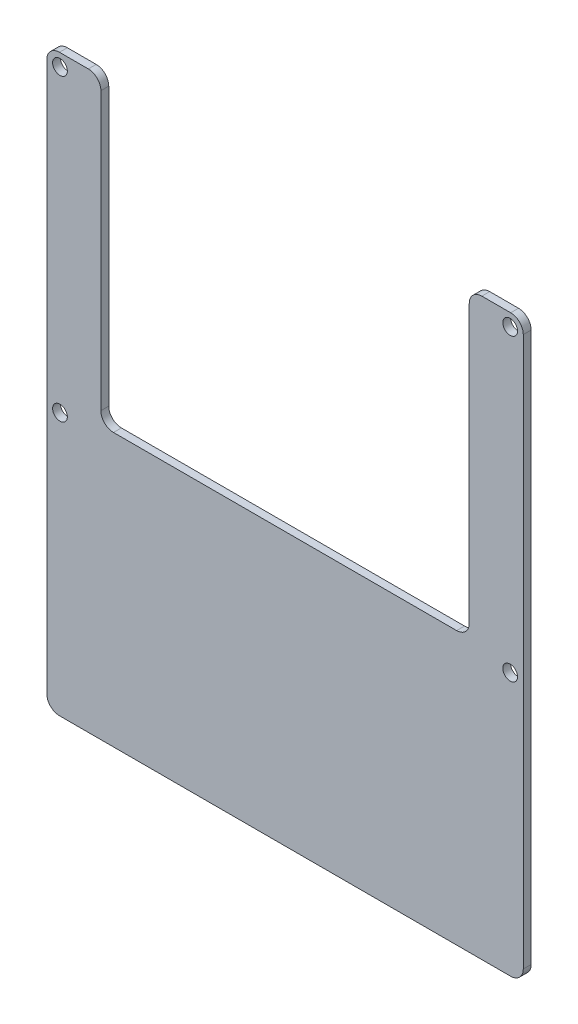
ISO-10303-21;
HEADER;
FILE_DESCRIPTION(('STEP AP214'),'2;1');
FILE_NAME('part.step','',(''),(''),'','','');
FILE_SCHEMA(('AUTOMOTIVE_DESIGN { 1 0 10303 214 1 1 1 1 }'));
ENDSEC;
DATA;
#1=APPLICATION_CONTEXT('core data for automotive mechanical design processes');
#2=APPLICATION_PROTOCOL_DEFINITION('international standard','automotive_design',2000,#1);
#3=PRODUCT_CONTEXT('',#1,'mechanical');
#4=PRODUCT('Part','Part','',(#3));
#5=PRODUCT_RELATED_PRODUCT_CATEGORY('part','',(#4));
#6=PRODUCT_DEFINITION_FORMATION('','',#4);
#7=PRODUCT_DEFINITION_CONTEXT('part definition',#1,'design');
#8=PRODUCT_DEFINITION('design','',#6,#7);
#9=PRODUCT_DEFINITION_SHAPE('','',#8);
#10=(LENGTH_UNIT() NAMED_UNIT(*) SI_UNIT(.MILLI.,.METRE.));
#11=(NAMED_UNIT(*) PLANE_ANGLE_UNIT() SI_UNIT($,.RADIAN.));
#12=(NAMED_UNIT(*) SI_UNIT($,.STERADIAN.) SOLID_ANGLE_UNIT());
#13=UNCERTAINTY_MEASURE_WITH_UNIT(LENGTH_MEASURE(1.E-05),#10,'distance_accuracy_value','');
#14=(GEOMETRIC_REPRESENTATION_CONTEXT(3) GLOBAL_UNCERTAINTY_ASSIGNED_CONTEXT((#13)) GLOBAL_UNIT_ASSIGNED_CONTEXT((#10,
#11,#12)) REPRESENTATION_CONTEXT('',''));
#15=CARTESIAN_POINT('',(0.,0.,0.));
#16=DIRECTION('',(0.,0.,1.));
#17=DIRECTION('',(1.,0.,0.));
#18=AXIS2_PLACEMENT_3D('',#15,#16,#17);
#19=CARTESIAN_POINT('',(0.,0.,1.6));
#20=DIRECTION('',(0.,0.,1.));
#21=DIRECTION('',(1.,0.,0.));
#22=AXIS2_PLACEMENT_3D('',#19,#20,#21);
#23=PLANE('',#22);
#24=CARTESIAN_POINT('',(22.6657,73.5,1.6));
#25=DIRECTION('',(0.,0.,1.));
#26=DIRECTION('',(1.,0.,0.));
#27=AXIS2_PLACEMENT_3D('',#24,#25,#26);
#28=CIRCLE('',#27,1.5);
#29=CARTESIAN_POINT('',(24.1657,73.5,1.6));
#30=VERTEX_POINT('',#29);
#31=EDGE_CURVE('E345',#30,#30,#28,.T.);
#32=ORIENTED_EDGE('',*,*,#31,.F.);
#33=EDGE_LOOP('',(#32));
#34=FACE_BOUND('',#33,.T.);
#35=CARTESIAN_POINT('',(22.6657,134.46,1.6));
#36=DIRECTION('',(0.,0.,1.));
#37=DIRECTION('',(1.,0.,0.));
#38=AXIS2_PLACEMENT_3D('',#35,#36,#37);
#39=CIRCLE('',#38,1.5);
#40=CARTESIAN_POINT('',(24.1657,134.46,1.6));
#41=VERTEX_POINT('',#40);
#42=EDGE_CURVE('E319',#41,#41,#39,.T.);
#43=ORIENTED_EDGE('',*,*,#42,.F.);
#44=EDGE_LOOP('',(#43));
#45=FACE_BOUND('',#44,.T.);
#46=DIRECTION('',(0.,1.,0.));
#47=VECTOR('',#46,1.);
#48=CARTESIAN_POINT('',(31.,137.,1.6));
#49=LINE('',#48,#47);
#50=CARTESIAN_POINT('',(31.,78.02,1.6));
#51=VERTEX_POINT('',#50);
#52=CARTESIAN_POINT('',(31.,134.44,1.6));
#53=VERTEX_POINT('',#52);
#54=EDGE_CURVE('E301',#51,#53,#49,.T.);
#55=ORIENTED_EDGE('',*,*,#54,.T.);
#56=CARTESIAN_POINT('',(28.44,134.44,1.6));
#57=DIRECTION('',(0.,0.,1.));
#58=DIRECTION('',(1.,0.,0.));
#59=AXIS2_PLACEMENT_3D('',#56,#57,#58);
#60=CIRCLE('',#59,2.56);
#61=CARTESIAN_POINT('',(28.44,137.,1.6));
#62=VERTEX_POINT('',#61);
#63=EDGE_CURVE('E232',#53,#62,#60,.T.);
#64=ORIENTED_EDGE('',*,*,#63,.T.);
#65=DIRECTION('',(-1.,0.,0.));
#66=VECTOR('',#65,1.);
#67=CARTESIAN_POINT('',(20.,137.,1.6));
#68=LINE('',#67,#66);
#69=CARTESIAN_POINT('',(22.56,137.,1.6));
#70=VERTEX_POINT('',#69);
#71=EDGE_CURVE('E176',#62,#70,#68,.T.);
#72=ORIENTED_EDGE('',*,*,#71,.T.);
#73=CARTESIAN_POINT('',(22.56,134.44,1.6));
#74=DIRECTION('',(0.,0.,1.));
#75=DIRECTION('',(1.,0.,0.));
#76=AXIS2_PLACEMENT_3D('',#73,#74,#75);
#77=CIRCLE('',#76,2.56);
#78=CARTESIAN_POINT('',(20.,134.44,1.6));
#79=VERTEX_POINT('',#78);
#80=EDGE_CURVE('E217',#70,#79,#77,.T.);
#81=ORIENTED_EDGE('',*,*,#80,.T.);
#82=DIRECTION('',(0.,-1.,0.));
#83=VECTOR('',#82,1.);
#84=CARTESIAN_POINT('',(20.,137.,1.6));
#85=LINE('',#84,#83);
#86=CARTESIAN_POINT('',(20.,22.56,1.6));
#87=VERTEX_POINT('',#86);
#88=EDGE_CURVE('E185',#79,#87,#85,.T.);
#89=ORIENTED_EDGE('',*,*,#88,.T.);
#90=CARTESIAN_POINT('',(22.56,22.56,1.6));
#91=DIRECTION('',(0.,0.,1.));
#92=DIRECTION('',(1.,0.,0.));
#93=AXIS2_PLACEMENT_3D('',#90,#91,#92);
#94=CIRCLE('',#93,2.56);
#95=CARTESIAN_POINT('',(22.56,20.,1.6));
#96=VERTEX_POINT('',#95);
#97=EDGE_CURVE('E220',#87,#96,#94,.T.);
#98=ORIENTED_EDGE('',*,*,#97,.T.);
#99=DIRECTION('',(1.,0.,0.));
#100=VECTOR('',#99,1.);
#101=CARTESIAN_POINT('',(20.,20.,1.6));
#102=LINE('',#101,#100);
#103=CARTESIAN_POINT('',(114.44,20.,1.6));
#104=VERTEX_POINT('',#103);
#105=EDGE_CURVE('E191',#96,#104,#102,.T.);
#106=ORIENTED_EDGE('',*,*,#105,.T.);
#107=CARTESIAN_POINT('',(114.44,22.56,1.6));
#108=DIRECTION('',(0.,0.,1.));
#109=DIRECTION('',(1.,0.,0.));
#110=AXIS2_PLACEMENT_3D('',#107,#108,#109);
#111=CIRCLE('',#110,2.56);
#112=CARTESIAN_POINT('',(117.,22.56,1.6));
#113=VERTEX_POINT('',#112);
#114=EDGE_CURVE('E223',#104,#113,#111,.T.);
#115=ORIENTED_EDGE('',*,*,#114,.T.);
#116=DIRECTION('',(0.,1.,0.));
#117=VECTOR('',#116,1.);
#118=CARTESIAN_POINT('',(117.,20.,1.6));
#119=LINE('',#118,#117);
#120=CARTESIAN_POINT('',(117.,134.44,1.6));
#121=VERTEX_POINT('',#120);
#122=EDGE_CURVE('E367',#113,#121,#119,.T.);
#123=ORIENTED_EDGE('',*,*,#122,.T.);
#124=CARTESIAN_POINT('',(114.44,134.44,1.6));
#125=DIRECTION('',(0.,0.,1.));
#126=DIRECTION('',(1.,0.,0.));
#127=AXIS2_PLACEMENT_3D('',#124,#125,#126);
#128=CIRCLE('',#127,2.56);
#129=CARTESIAN_POINT('',(114.44,137.,1.6));
#130=VERTEX_POINT('',#129);
#131=EDGE_CURVE('E226',#121,#130,#128,.T.);
#132=ORIENTED_EDGE('',*,*,#131,.T.);
#133=DIRECTION('',(-1.,0.,0.));
#134=VECTOR('',#133,1.);
#135=CARTESIAN_POINT('',(106.,137.,1.6));
#136=LINE('',#135,#134);
#137=CARTESIAN_POINT('',(108.56,137.,1.6));
#138=VERTEX_POINT('',#137);
#139=EDGE_CURVE('E308',#130,#138,#136,.T.);
#140=ORIENTED_EDGE('',*,*,#139,.T.);
#141=CARTESIAN_POINT('',(108.56,134.44,1.6));
#142=DIRECTION('',(0.,0.,1.));
#143=DIRECTION('',(1.,0.,0.));
#144=AXIS2_PLACEMENT_3D('',#141,#142,#143);
#145=CIRCLE('',#144,2.56);
#146=CARTESIAN_POINT('',(106.,134.44,1.6));
#147=VERTEX_POINT('',#146);
#148=EDGE_CURVE('E229',#138,#147,#145,.T.);
#149=ORIENTED_EDGE('',*,*,#148,.T.);
#150=DIRECTION('',(0.,-1.,0.));
#151=VECTOR('',#150,1.);
#152=CARTESIAN_POINT('',(106.,75.46,1.6));
#153=LINE('',#152,#151);
#154=CARTESIAN_POINT('',(106.,78.02,1.6));
#155=VERTEX_POINT('',#154);
#156=EDGE_CURVE('E302',#147,#155,#153,.T.);
#157=ORIENTED_EDGE('',*,*,#156,.T.);
#158=CARTESIAN_POINT('',(103.44,78.02,1.6));
#159=DIRECTION('',(0.,0.,1.));
#160=DIRECTION('',(1.,0.,0.));
#161=AXIS2_PLACEMENT_3D('',#158,#159,#160);
#162=CIRCLE('',#161,2.56);
#163=CARTESIAN_POINT('',(103.44,75.46,1.6));
#164=VERTEX_POINT('',#163);
#165=EDGE_CURVE('E11',#155,#164,#162,.F.);
#166=ORIENTED_EDGE('',*,*,#165,.T.);
#167=DIRECTION('',(-1.,0.,0.));
#168=VECTOR('',#167,1.);
#169=CARTESIAN_POINT('',(31.,75.46,1.6));
#170=LINE('',#169,#168);
#171=CARTESIAN_POINT('',(33.56,75.46,1.6));
#172=VERTEX_POINT('',#171);
#173=EDGE_CURVE('E298',#164,#172,#170,.T.);
#174=ORIENTED_EDGE('',*,*,#173,.T.);
#175=CARTESIAN_POINT('',(33.56,78.02,1.6));
#176=DIRECTION('',(0.,0.,1.));
#177=DIRECTION('',(1.,0.,0.));
#178=AXIS2_PLACEMENT_3D('',#175,#176,#177);
#179=CIRCLE('',#178,2.56);
#180=EDGE_CURVE('E279',#172,#51,#179,.F.);
#181=ORIENTED_EDGE('',*,*,#180,.T.);
#182=EDGE_LOOP('',(#55,#64,#72,#81,#89,#98,#106,#115,#123,#132,#140,#149,#157,#166,#174,#181));
#183=FACE_BOUND('',#182,.T.);
#184=CARTESIAN_POINT('',(114.3343,134.46,1.6));
#185=DIRECTION('',(0.,0.,1.));
#186=DIRECTION('',(1.,0.,0.));
#187=AXIS2_PLACEMENT_3D('',#184,#185,#186);
#188=CIRCLE('',#187,1.5);
#189=CARTESIAN_POINT('',(115.8343,134.46,1.6));
#190=VERTEX_POINT('',#189);
#191=EDGE_CURVE('E337',#190,#190,#188,.T.);
#192=ORIENTED_EDGE('',*,*,#191,.F.);
#193=EDGE_LOOP('',(#192));
#194=FACE_BOUND('',#193,.T.);
#195=CARTESIAN_POINT('',(114.3343,73.5000000000001,1.6));
#196=DIRECTION('',(0.,0.,1.));
#197=DIRECTION('',(1.,0.,0.));
#198=AXIS2_PLACEMENT_3D('',#195,#196,#197);
#199=CIRCLE('',#198,1.5);
#200=CARTESIAN_POINT('',(115.8343,73.5000000000001,1.6));
#201=VERTEX_POINT('',#200);
#202=EDGE_CURVE('E353',#201,#201,#199,.T.);
#203=ORIENTED_EDGE('',*,*,#202,.F.);
#204=EDGE_LOOP('',(#203));
#205=FACE_BOUND('',#204,.T.);
#206=ADVANCED_FACE('F41',(#34,#45,#183,#194,#205),#23,.T.);
#207=CARTESIAN_POINT('',(0.,0.,0.));
#208=DIRECTION('',(0.,0.,1.));
#209=DIRECTION('',(1.,0.,0.));
#210=AXIS2_PLACEMENT_3D('',#207,#208,#209);
#211=PLANE('',#210);
#212=DIRECTION('',(-1.,0.,0.));
#213=VECTOR('',#212,1.);
#214=CARTESIAN_POINT('',(20.,137.,0.));
#215=LINE('',#214,#213);
#216=CARTESIAN_POINT('',(28.44,137.,0.));
#217=VERTEX_POINT('',#216);
#218=CARTESIAN_POINT('',(22.56,137.,0.));
#219=VERTEX_POINT('',#218);
#220=EDGE_CURVE('E173',#217,#219,#215,.T.);
#221=ORIENTED_EDGE('',*,*,#220,.F.);
#222=CARTESIAN_POINT('',(28.44,134.44,0.));
#223=DIRECTION('',(0.,0.,1.));
#224=DIRECTION('',(1.,0.,0.));
#225=AXIS2_PLACEMENT_3D('',#222,#223,#224);
#226=CIRCLE('',#225,2.56);
#227=CARTESIAN_POINT('',(31.,134.44,0.));
#228=VERTEX_POINT('',#227);
#229=EDGE_CURVE('E155',#217,#228,#226,.F.);
#230=ORIENTED_EDGE('',*,*,#229,.T.);
#231=DIRECTION('',(0.,1.,0.));
#232=VECTOR('',#231,1.);
#233=CARTESIAN_POINT('',(31.,137.,0.));
#234=LINE('',#233,#232);
#235=CARTESIAN_POINT('',(31.,78.02,0.));
#236=VERTEX_POINT('',#235);
#237=EDGE_CURVE('E186',#236,#228,#234,.T.);
#238=ORIENTED_EDGE('',*,*,#237,.F.);
#239=CARTESIAN_POINT('',(33.56,78.02,0.));
#240=DIRECTION('',(0.,0.,1.));
#241=DIRECTION('',(1.,0.,0.));
#242=AXIS2_PLACEMENT_3D('',#239,#240,#241);
#243=CIRCLE('',#242,2.56);
#244=CARTESIAN_POINT('',(33.56,75.46,0.));
#245=VERTEX_POINT('',#244);
#246=EDGE_CURVE('E276',#236,#245,#243,.T.);
#247=ORIENTED_EDGE('',*,*,#246,.T.);
#248=DIRECTION('',(-1.,0.,0.));
#249=VECTOR('',#248,1.);
#250=CARTESIAN_POINT('',(31.,75.46,0.));
#251=LINE('',#250,#249);
#252=CARTESIAN_POINT('',(103.44,75.46,0.));
#253=VERTEX_POINT('',#252);
#254=EDGE_CURVE('E193',#253,#245,#251,.T.);
#255=ORIENTED_EDGE('',*,*,#254,.F.);
#256=CARTESIAN_POINT('',(103.44,78.02,0.));
#257=DIRECTION('',(0.,0.,1.));
#258=DIRECTION('',(1.,0.,0.));
#259=AXIS2_PLACEMENT_3D('',#256,#257,#258);
#260=CIRCLE('',#259,2.56);
#261=CARTESIAN_POINT('',(106.,78.02,0.));
#262=VERTEX_POINT('',#261);
#263=EDGE_CURVE('E50',#253,#262,#260,.T.);
#264=ORIENTED_EDGE('',*,*,#263,.T.);
#265=DIRECTION('',(0.,-1.,0.));
#266=VECTOR('',#265,1.);
#267=CARTESIAN_POINT('',(106.,75.46,0.));
#268=LINE('',#267,#266);
#269=CARTESIAN_POINT('',(106.,134.44,0.));
#270=VERTEX_POINT('',#269);
#271=EDGE_CURVE('E285',#270,#262,#268,.T.);
#272=ORIENTED_EDGE('',*,*,#271,.F.);
#273=CARTESIAN_POINT('',(108.56,134.44,0.));
#274=DIRECTION('',(0.,0.,1.));
#275=DIRECTION('',(1.,0.,0.));
#276=AXIS2_PLACEMENT_3D('',#273,#274,#275);
#277=CIRCLE('',#276,2.56);
#278=CARTESIAN_POINT('',(108.56,137.,0.));
#279=VERTEX_POINT('',#278);
#280=EDGE_CURVE('E167',#270,#279,#277,.F.);
#281=ORIENTED_EDGE('',*,*,#280,.T.);
#282=DIRECTION('',(-1.,0.,0.));
#283=VECTOR('',#282,1.);
#284=CARTESIAN_POINT('',(106.,137.,0.));
#285=LINE('',#284,#283);
#286=CARTESIAN_POINT('',(114.44,137.,0.));
#287=VERTEX_POINT('',#286);
#288=EDGE_CURVE('E294',#287,#279,#285,.T.);
#289=ORIENTED_EDGE('',*,*,#288,.F.);
#290=CARTESIAN_POINT('',(114.44,134.44,0.));
#291=DIRECTION('',(0.,0.,1.));
#292=DIRECTION('',(1.,0.,0.));
#293=AXIS2_PLACEMENT_3D('',#290,#291,#292);
#294=CIRCLE('',#293,2.56);
#295=CARTESIAN_POINT('',(117.,134.44,0.));
#296=VERTEX_POINT('',#295);
#297=EDGE_CURVE('E207',#287,#296,#294,.F.);
#298=ORIENTED_EDGE('',*,*,#297,.T.);
#299=DIRECTION('',(0.,1.,0.));
#300=VECTOR('',#299,1.);
#301=CARTESIAN_POINT('',(117.,20.,0.));
#302=LINE('',#301,#300);
#303=CARTESIAN_POINT('',(117.,22.56,0.));
#304=VERTEX_POINT('',#303);
#305=EDGE_CURVE('E323',#304,#296,#302,.T.);
#306=ORIENTED_EDGE('',*,*,#305,.F.);
#307=CARTESIAN_POINT('',(114.44,22.56,0.));
#308=DIRECTION('',(0.,0.,1.));
#309=DIRECTION('',(1.,0.,0.));
#310=AXIS2_PLACEMENT_3D('',#307,#308,#309);
#311=CIRCLE('',#310,2.56);
#312=CARTESIAN_POINT('',(114.44,20.,0.));
#313=VERTEX_POINT('',#312);
#314=EDGE_CURVE('E204',#304,#313,#311,.F.);
#315=ORIENTED_EDGE('',*,*,#314,.T.);
#316=DIRECTION('',(1.,0.,0.));
#317=VECTOR('',#316,1.);
#318=CARTESIAN_POINT('',(20.,20.,0.));
#319=LINE('',#318,#317);
#320=CARTESIAN_POINT('',(22.56,20.,0.));
#321=VERTEX_POINT('',#320);
#322=EDGE_CURVE('E318',#321,#313,#319,.T.);
#323=ORIENTED_EDGE('',*,*,#322,.F.);
#324=CARTESIAN_POINT('',(22.56,22.56,0.));
#325=DIRECTION('',(0.,0.,1.));
#326=DIRECTION('',(1.,0.,0.));
#327=AXIS2_PLACEMENT_3D('',#324,#325,#326);
#328=CIRCLE('',#327,2.56);
#329=CARTESIAN_POINT('',(20.,22.56,0.));
#330=VERTEX_POINT('',#329);
#331=EDGE_CURVE('E201',#321,#330,#328,.F.);
#332=ORIENTED_EDGE('',*,*,#331,.T.);
#333=DIRECTION('',(0.,-1.,0.));
#334=VECTOR('',#333,1.);
#335=CARTESIAN_POINT('',(20.,137.,0.));
#336=LINE('',#335,#334);
#337=CARTESIAN_POINT('',(20.,134.44,0.));
#338=VERTEX_POINT('',#337);
#339=EDGE_CURVE('E314',#338,#330,#336,.T.);
#340=ORIENTED_EDGE('',*,*,#339,.F.);
#341=CARTESIAN_POINT('',(22.56,134.44,0.));
#342=DIRECTION('',(0.,0.,1.));
#343=DIRECTION('',(1.,0.,0.));
#344=AXIS2_PLACEMENT_3D('',#341,#342,#343);
#345=CIRCLE('',#344,2.56);
#346=EDGE_CURVE('E178',#338,#219,#345,.F.);
#347=ORIENTED_EDGE('',*,*,#346,.T.);
#348=EDGE_LOOP('',(#221,#230,#238,#247,#255,#264,#272,#281,#289,#298,#306,#315,#323,#332,#340,#347));
#349=FACE_BOUND('',#348,.T.);
#350=CARTESIAN_POINT('',(22.6657,134.46,0.));
#351=DIRECTION('',(0.,0.,1.));
#352=DIRECTION('',(1.,0.,0.));
#353=AXIS2_PLACEMENT_3D('',#350,#351,#352);
#354=CIRCLE('',#353,1.5);
#355=CARTESIAN_POINT('',(24.1657,134.46,0.));
#356=VERTEX_POINT('',#355);
#357=EDGE_CURVE('E333',#356,#356,#354,.T.);
#358=ORIENTED_EDGE('',*,*,#357,.T.);
#359=EDGE_LOOP('',(#358));
#360=FACE_BOUND('',#359,.T.);
#361=CARTESIAN_POINT('',(114.3343,134.46,0.));
#362=DIRECTION('',(0.,0.,1.));
#363=DIRECTION('',(1.,0.,0.));
#364=AXIS2_PLACEMENT_3D('',#361,#362,#363);
#365=CIRCLE('',#364,1.5);
#366=CARTESIAN_POINT('',(115.8343,134.46,0.));
#367=VERTEX_POINT('',#366);
#368=EDGE_CURVE('E341',#367,#367,#365,.T.);
#369=ORIENTED_EDGE('',*,*,#368,.T.);
#370=EDGE_LOOP('',(#369));
#371=FACE_BOUND('',#370,.T.);
#372=CARTESIAN_POINT('',(22.6657,73.5,0.));
#373=DIRECTION('',(0.,0.,1.));
#374=DIRECTION('',(1.,0.,0.));
#375=AXIS2_PLACEMENT_3D('',#372,#373,#374);
#376=CIRCLE('',#375,1.5);
#377=CARTESIAN_POINT('',(24.1657,73.5,0.));
#378=VERTEX_POINT('',#377);
#379=EDGE_CURVE('E349',#378,#378,#376,.T.);
#380=ORIENTED_EDGE('',*,*,#379,.T.);
#381=EDGE_LOOP('',(#380));
#382=FACE_BOUND('',#381,.T.);
#383=CARTESIAN_POINT('',(114.3343,73.5000000000001,0.));
#384=DIRECTION('',(0.,0.,1.));
#385=DIRECTION('',(1.,0.,0.));
#386=AXIS2_PLACEMENT_3D('',#383,#384,#385);
#387=CIRCLE('',#386,1.5);
#388=CARTESIAN_POINT('',(115.8343,73.5000000000001,0.));
#389=VERTEX_POINT('',#388);
#390=EDGE_CURVE('E357',#389,#389,#387,.T.);
#391=ORIENTED_EDGE('',*,*,#390,.T.);
#392=EDGE_LOOP('',(#391));
#393=FACE_BOUND('',#392,.T.);
#394=ADVANCED_FACE('F181',(#349,#360,#371,#382,#393),#211,.F.);
#395=CARTESIAN_POINT('',(20.,137.,1.6));
#396=DIRECTION('',(1.,0.,0.));
#397=DIRECTION('',(0.,0.,-1.));
#398=AXIS2_PLACEMENT_3D('',#395,#396,#397);
#399=PLANE('',#398);
#400=ORIENTED_EDGE('',*,*,#339,.T.);
#401=DIRECTION('',(0.,0.,-1.));
#402=VECTOR('',#401,1.);
#403=CARTESIAN_POINT('',(20.,22.56,1.6));
#404=LINE('',#403,#402);
#405=EDGE_CURVE('E273',#330,#87,#404,.F.);
#406=ORIENTED_EDGE('',*,*,#405,.T.);
#407=ORIENTED_EDGE('',*,*,#88,.F.);
#408=DIRECTION('',(0.,0.,-1.));
#409=VECTOR('',#408,1.);
#410=CARTESIAN_POINT('',(20.,134.44,1.6));
#411=LINE('',#410,#409);
#412=EDGE_CURVE('E269',#79,#338,#411,.T.);
#413=ORIENTED_EDGE('',*,*,#412,.T.);
#414=EDGE_LOOP('',(#400,#406,#407,#413));
#415=FACE_BOUND('',#414,.T.);
#416=ADVANCED_FACE('F405',(#415),#399,.F.);
#417=CARTESIAN_POINT('',(20.,20.,1.6));
#418=DIRECTION('',(0.,1.,0.));
#419=DIRECTION('',(-1.,0.,0.));
#420=AXIS2_PLACEMENT_3D('',#417,#418,#419);
#421=PLANE('',#420);
#422=ORIENTED_EDGE('',*,*,#322,.T.);
#423=DIRECTION('',(0.,0.,-1.));
#424=VECTOR('',#423,1.);
#425=CARTESIAN_POINT('',(114.44,20.,1.6));
#426=LINE('',#425,#424);
#427=EDGE_CURVE('E266',#313,#104,#426,.F.);
#428=ORIENTED_EDGE('',*,*,#427,.T.);
#429=ORIENTED_EDGE('',*,*,#105,.F.);
#430=DIRECTION('',(0.,0.,-1.));
#431=VECTOR('',#430,1.);
#432=CARTESIAN_POINT('',(22.56,20.,1.6));
#433=LINE('',#432,#431);
#434=EDGE_CURVE('E262',#96,#321,#433,.T.);
#435=ORIENTED_EDGE('',*,*,#434,.T.);
#436=EDGE_LOOP('',(#422,#428,#429,#435));
#437=FACE_BOUND('',#436,.T.);
#438=ADVANCED_FACE('F397',(#437),#421,.F.);
#439=CARTESIAN_POINT('',(117.,20.,1.6));
#440=DIRECTION('',(-1.,0.,0.));
#441=DIRECTION('',(0.,-1.,0.));
#442=AXIS2_PLACEMENT_3D('',#439,#440,#441);
#443=PLANE('',#442);
#444=ORIENTED_EDGE('',*,*,#305,.T.);
#445=DIRECTION('',(0.,0.,-1.));
#446=VECTOR('',#445,1.);
#447=CARTESIAN_POINT('',(117.,134.44,1.6));
#448=LINE('',#447,#446);
#449=EDGE_CURVE('E259',#296,#121,#448,.F.);
#450=ORIENTED_EDGE('',*,*,#449,.T.);
#451=ORIENTED_EDGE('',*,*,#122,.F.);
#452=DIRECTION('',(0.,0.,-1.));
#453=VECTOR('',#452,1.);
#454=CARTESIAN_POINT('',(117.,22.56,1.6));
#455=LINE('',#454,#453);
#456=EDGE_CURVE('E255',#113,#304,#455,.T.);
#457=ORIENTED_EDGE('',*,*,#456,.T.);
#458=EDGE_LOOP('',(#444,#450,#451,#457));
#459=FACE_BOUND('',#458,.T.);
#460=ADVANCED_FACE('F388',(#459),#443,.F.);
#461=CARTESIAN_POINT('',(106.,137.,1.6));
#462=DIRECTION('',(0.,-1.,0.));
#463=DIRECTION('',(0.,0.,-1.));
#464=AXIS2_PLACEMENT_3D('',#461,#462,#463);
#465=PLANE('',#464);
#466=ORIENTED_EDGE('',*,*,#288,.T.);
#467=DIRECTION('',(0.,0.,-1.));
#468=VECTOR('',#467,1.);
#469=CARTESIAN_POINT('',(108.56,137.,1.6));
#470=LINE('',#469,#468);
#471=EDGE_CURVE('E252',#279,#138,#470,.F.);
#472=ORIENTED_EDGE('',*,*,#471,.T.);
#473=ORIENTED_EDGE('',*,*,#139,.F.);
#474=DIRECTION('',(0.,0.,-1.));
#475=VECTOR('',#474,1.);
#476=CARTESIAN_POINT('',(114.44,137.,1.6));
#477=LINE('',#476,#475);
#478=EDGE_CURVE('E248',#130,#287,#477,.T.);
#479=ORIENTED_EDGE('',*,*,#478,.T.);
#480=EDGE_LOOP('',(#466,#472,#473,#479));
#481=FACE_BOUND('',#480,.T.);
#482=ADVANCED_FACE('F382',(#481),#465,.F.);
#483=CARTESIAN_POINT('',(106.,75.46,1.6));
#484=DIRECTION('',(1.,0.,0.));
#485=DIRECTION('',(0.,1.,0.));
#486=AXIS2_PLACEMENT_3D('',#483,#484,#485);
#487=PLANE('',#486);
#488=ORIENTED_EDGE('',*,*,#271,.T.);
#489=DIRECTION('',(0.,0.,-1.));
#490=VECTOR('',#489,1.);
#491=CARTESIAN_POINT('',(106.,78.02,1.6));
#492=LINE('',#491,#490);
#493=EDGE_CURVE('E245',#262,#155,#492,.F.);
#494=ORIENTED_EDGE('',*,*,#493,.T.);
#495=ORIENTED_EDGE('',*,*,#156,.F.);
#496=DIRECTION('',(0.,0.,-1.));
#497=VECTOR('',#496,1.);
#498=CARTESIAN_POINT('',(106.,134.44,1.6));
#499=LINE('',#498,#497);
#500=EDGE_CURVE('E241',#147,#270,#499,.T.);
#501=ORIENTED_EDGE('',*,*,#500,.T.);
#502=EDGE_LOOP('',(#488,#494,#495,#501));
#503=FACE_BOUND('',#502,.T.);
#504=ADVANCED_FACE('F290',(#503),#487,.F.);
#505=CARTESIAN_POINT('',(31.,75.46,1.6));
#506=DIRECTION('',(0.,-1.,0.));
#507=DIRECTION('',(1.,0.,0.));
#508=AXIS2_PLACEMENT_3D('',#505,#506,#507);
#509=PLANE('',#508);
#510=ORIENTED_EDGE('',*,*,#254,.T.);
#511=DIRECTION('',(0.,0.,-1.));
#512=VECTOR('',#511,1.);
#513=CARTESIAN_POINT('',(33.56,75.46,1.6));
#514=LINE('',#513,#512);
#515=EDGE_CURVE('E57',#245,#172,#514,.F.);
#516=ORIENTED_EDGE('',*,*,#515,.T.);
#517=ORIENTED_EDGE('',*,*,#173,.F.);
#518=DIRECTION('',(0.,0.,-1.));
#519=VECTOR('',#518,1.);
#520=CARTESIAN_POINT('',(103.44,75.46,0.));
#521=LINE('',#520,#519);
#522=EDGE_CURVE('E235',#164,#253,#521,.T.);
#523=ORIENTED_EDGE('',*,*,#522,.T.);
#524=EDGE_LOOP('',(#510,#516,#517,#523));
#525=FACE_BOUND('',#524,.T.);
#526=ADVANCED_FACE('F297',(#525),#509,.F.);
#527=CARTESIAN_POINT('',(31.,137.,1.6));
#528=DIRECTION('',(-1.,0.,0.));
#529=DIRECTION('',(0.,-1.,0.));
#530=AXIS2_PLACEMENT_3D('',#527,#528,#529);
#531=PLANE('',#530);
#532=ORIENTED_EDGE('',*,*,#237,.T.);
#533=DIRECTION('',(0.,0.,-1.));
#534=VECTOR('',#533,1.);
#535=CARTESIAN_POINT('',(31.,134.44,1.6));
#536=LINE('',#535,#534);
#537=EDGE_CURVE('E160',#228,#53,#536,.F.);
#538=ORIENTED_EDGE('',*,*,#537,.T.);
#539=ORIENTED_EDGE('',*,*,#54,.F.);
#540=DIRECTION('',(0.,0.,-1.));
#541=VECTOR('',#540,1.);
#542=CARTESIAN_POINT('',(31.,78.02,0.));
#543=LINE('',#542,#541);
#544=EDGE_CURVE('E166',#51,#236,#543,.T.);
#545=ORIENTED_EDGE('',*,*,#544,.T.);
#546=EDGE_LOOP('',(#532,#538,#539,#545));
#547=FACE_BOUND('',#546,.T.);
#548=ADVANCED_FACE('F413',(#547),#531,.F.);
#549=CARTESIAN_POINT('',(20.,137.,1.6));
#550=DIRECTION('',(0.,-1.,0.));
#551=DIRECTION('',(0.,0.,-1.));
#552=AXIS2_PLACEMENT_3D('',#549,#550,#551);
#553=PLANE('',#552);
#554=ORIENTED_EDGE('',*,*,#71,.F.);
#555=DIRECTION('',(0.,0.,-1.));
#556=VECTOR('',#555,1.);
#557=CARTESIAN_POINT('',(28.44,137.,1.6));
#558=LINE('',#557,#556);
#559=EDGE_CURVE('E159',#62,#217,#558,.T.);
#560=ORIENTED_EDGE('',*,*,#559,.T.);
#561=ORIENTED_EDGE('',*,*,#220,.T.);
#562=DIRECTION('',(0.,0.,-1.));
#563=VECTOR('',#562,1.);
#564=CARTESIAN_POINT('',(22.56,137.,1.6));
#565=LINE('',#564,#563);
#566=EDGE_CURVE('E179',#219,#70,#565,.F.);
#567=ORIENTED_EDGE('',*,*,#566,.T.);
#568=EDGE_LOOP('',(#554,#560,#561,#567));
#569=FACE_BOUND('',#568,.T.);
#570=ADVANCED_FACE('F172',(#569),#553,.F.);
#571=CARTESIAN_POINT('',(22.6657,134.46,1.6));
#572=DIRECTION('',(0.,0.,-1.));
#573=DIRECTION('',(-1.,0.,0.));
#574=AXIS2_PLACEMENT_3D('',#571,#572,#573);
#575=CYLINDRICAL_SURFACE('',#574,1.5);
#576=ORIENTED_EDGE('',*,*,#42,.T.);
#577=EDGE_LOOP('',(#576));
#578=FACE_BOUND('',#577,.T.);
#579=ORIENTED_EDGE('',*,*,#357,.F.);
#580=EDGE_LOOP('',(#579));
#581=FACE_BOUND('',#580,.T.);
#582=ADVANCED_FACE('F435',(#578,#581),#575,.F.);
#583=CARTESIAN_POINT('',(114.3343,134.46,1.6));
#584=DIRECTION('',(0.,0.,-1.));
#585=DIRECTION('',(-1.,0.,0.));
#586=AXIS2_PLACEMENT_3D('',#583,#584,#585);
#587=CYLINDRICAL_SURFACE('',#586,1.5);
#588=ORIENTED_EDGE('',*,*,#191,.T.);
#589=EDGE_LOOP('',(#588));
#590=FACE_BOUND('',#589,.T.);
#591=ORIENTED_EDGE('',*,*,#368,.F.);
#592=EDGE_LOOP('',(#591));
#593=FACE_BOUND('',#592,.T.);
#594=ADVANCED_FACE('F492',(#590,#593),#587,.F.);
#595=CARTESIAN_POINT('',(22.6657,73.5,1.6));
#596=DIRECTION('',(0.,0.,-1.));
#597=DIRECTION('',(-1.,0.,0.));
#598=AXIS2_PLACEMENT_3D('',#595,#596,#597);
#599=CYLINDRICAL_SURFACE('',#598,1.5);
#600=ORIENTED_EDGE('',*,*,#31,.T.);
#601=EDGE_LOOP('',(#600));
#602=FACE_BOUND('',#601,.T.);
#603=ORIENTED_EDGE('',*,*,#379,.F.);
#604=EDGE_LOOP('',(#603));
#605=FACE_BOUND('',#604,.T.);
#606=ADVANCED_FACE('F499',(#602,#605),#599,.F.);
#607=CARTESIAN_POINT('',(114.3343,73.5000000000001,1.6));
#608=DIRECTION('',(0.,0.,-1.));
#609=DIRECTION('',(-1.,0.,0.));
#610=AXIS2_PLACEMENT_3D('',#607,#608,#609);
#611=CYLINDRICAL_SURFACE('',#610,1.5);
#612=ORIENTED_EDGE('',*,*,#202,.T.);
#613=EDGE_LOOP('',(#612));
#614=FACE_BOUND('',#613,.T.);
#615=ORIENTED_EDGE('',*,*,#390,.F.);
#616=EDGE_LOOP('',(#615));
#617=FACE_BOUND('',#616,.T.);
#618=ADVANCED_FACE('F423',(#614,#617),#611,.F.);
#619=CARTESIAN_POINT('',(28.44,134.44,1.6));
#620=DIRECTION('',(0.,0.,-1.));
#621=DIRECTION('',(-1.,0.,0.));
#622=AXIS2_PLACEMENT_3D('',#619,#620,#621);
#623=CYLINDRICAL_SURFACE('',#622,2.56);
#624=ORIENTED_EDGE('',*,*,#63,.F.);
#625=ORIENTED_EDGE('',*,*,#537,.F.);
#626=ORIENTED_EDGE('',*,*,#229,.F.);
#627=ORIENTED_EDGE('',*,*,#559,.F.);
#628=EDGE_LOOP('',(#624,#625,#626,#627));
#629=FACE_BOUND('',#628,.T.);
#630=ADVANCED_FACE('F158',(#629),#623,.T.);
#631=CARTESIAN_POINT('',(33.56,78.02,1.6));
#632=DIRECTION('',(0.,0.,1.));
#633=DIRECTION('',(1.,0.,0.));
#634=AXIS2_PLACEMENT_3D('',#631,#632,#633);
#635=CYLINDRICAL_SURFACE('',#634,2.56);
#636=ORIENTED_EDGE('',*,*,#180,.F.);
#637=ORIENTED_EDGE('',*,*,#515,.F.);
#638=ORIENTED_EDGE('',*,*,#246,.F.);
#639=ORIENTED_EDGE('',*,*,#544,.F.);
#640=EDGE_LOOP('',(#636,#637,#638,#639));
#641=FACE_BOUND('',#640,.T.);
#642=ADVANCED_FACE('F415',(#641),#635,.F.);
#643=CARTESIAN_POINT('',(103.44,78.02,1.6));
#644=DIRECTION('',(0.,0.,1.));
#645=DIRECTION('',(1.,0.,0.));
#646=AXIS2_PLACEMENT_3D('',#643,#644,#645);
#647=CYLINDRICAL_SURFACE('',#646,2.56);
#648=ORIENTED_EDGE('',*,*,#165,.F.);
#649=ORIENTED_EDGE('',*,*,#493,.F.);
#650=ORIENTED_EDGE('',*,*,#263,.F.);
#651=ORIENTED_EDGE('',*,*,#522,.F.);
#652=EDGE_LOOP('',(#648,#649,#650,#651));
#653=FACE_BOUND('',#652,.T.);
#654=ADVANCED_FACE('F296',(#653),#647,.F.);
#655=CARTESIAN_POINT('',(108.56,134.44,1.6));
#656=DIRECTION('',(0.,0.,-1.));
#657=DIRECTION('',(-1.,0.,0.));
#658=AXIS2_PLACEMENT_3D('',#655,#656,#657);
#659=CYLINDRICAL_SURFACE('',#658,2.56);
#660=ORIENTED_EDGE('',*,*,#148,.F.);
#661=ORIENTED_EDGE('',*,*,#471,.F.);
#662=ORIENTED_EDGE('',*,*,#280,.F.);
#663=ORIENTED_EDGE('',*,*,#500,.F.);
#664=EDGE_LOOP('',(#660,#661,#662,#663));
#665=FACE_BOUND('',#664,.T.);
#666=ADVANCED_FACE('F380',(#665),#659,.T.);
#667=CARTESIAN_POINT('',(114.44,134.44,1.6));
#668=DIRECTION('',(0.,0.,-1.));
#669=DIRECTION('',(-1.,0.,0.));
#670=AXIS2_PLACEMENT_3D('',#667,#668,#669);
#671=CYLINDRICAL_SURFACE('',#670,2.56);
#672=ORIENTED_EDGE('',*,*,#131,.F.);
#673=ORIENTED_EDGE('',*,*,#449,.F.);
#674=ORIENTED_EDGE('',*,*,#297,.F.);
#675=ORIENTED_EDGE('',*,*,#478,.F.);
#676=EDGE_LOOP('',(#672,#673,#674,#675));
#677=FACE_BOUND('',#676,.T.);
#678=ADVANCED_FACE('F384',(#677),#671,.T.);
#679=CARTESIAN_POINT('',(114.44,22.56,1.6));
#680=DIRECTION('',(0.,0.,-1.));
#681=DIRECTION('',(-1.,0.,0.));
#682=AXIS2_PLACEMENT_3D('',#679,#680,#681);
#683=CYLINDRICAL_SURFACE('',#682,2.56);
#684=ORIENTED_EDGE('',*,*,#114,.F.);
#685=ORIENTED_EDGE('',*,*,#427,.F.);
#686=ORIENTED_EDGE('',*,*,#314,.F.);
#687=ORIENTED_EDGE('',*,*,#456,.F.);
#688=EDGE_LOOP('',(#684,#685,#686,#687));
#689=FACE_BOUND('',#688,.T.);
#690=ADVANCED_FACE('F393',(#689),#683,.T.);
#691=CARTESIAN_POINT('',(22.56,22.56,1.6));
#692=DIRECTION('',(0.,0.,-1.));
#693=DIRECTION('',(-1.,0.,0.));
#694=AXIS2_PLACEMENT_3D('',#691,#692,#693);
#695=CYLINDRICAL_SURFACE('',#694,2.56);
#696=ORIENTED_EDGE('',*,*,#97,.F.);
#697=ORIENTED_EDGE('',*,*,#405,.F.);
#698=ORIENTED_EDGE('',*,*,#331,.F.);
#699=ORIENTED_EDGE('',*,*,#434,.F.);
#700=EDGE_LOOP('',(#696,#697,#698,#699));
#701=FACE_BOUND('',#700,.T.);
#702=ADVANCED_FACE('F402',(#701),#695,.T.);
#703=CARTESIAN_POINT('',(22.56,134.44,1.6));
#704=DIRECTION('',(0.,0.,-1.));
#705=DIRECTION('',(-1.,0.,0.));
#706=AXIS2_PLACEMENT_3D('',#703,#704,#705);
#707=CYLINDRICAL_SURFACE('',#706,2.56);
#708=ORIENTED_EDGE('',*,*,#80,.F.);
#709=ORIENTED_EDGE('',*,*,#566,.F.);
#710=ORIENTED_EDGE('',*,*,#346,.F.);
#711=ORIENTED_EDGE('',*,*,#412,.F.);
#712=EDGE_LOOP('',(#708,#709,#710,#711));
#713=FACE_BOUND('',#712,.T.);
#714=ADVANCED_FACE('F43',(#713),#707,.T.);
#715=CLOSED_SHELL('',(#206,#394,#416,#438,#460,#482,#504,#526,#548,#570,#582,#594,#606,#618,
#630,#642,#654,#666,#678,#690,#702,#714));
#716=MANIFOLD_SOLID_BREP('B2',#715);
#717=ADVANCED_BREP_SHAPE_REPRESENTATION('',(#18,#716),#14);
#718=SHAPE_DEFINITION_REPRESENTATION(#9,#717);
ENDSEC;
END-ISO-10303-21;
